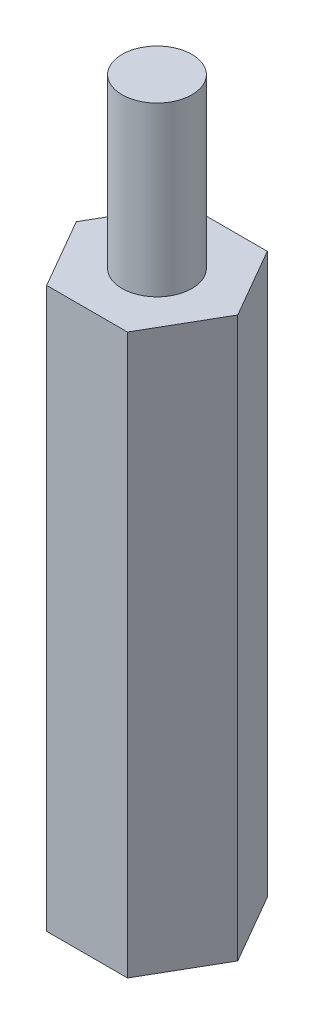
ISO-10303-21;
HEADER;
FILE_DESCRIPTION(('STEP AP214'),'2;1');
FILE_NAME('part.step','',(''),(''),'','','');
FILE_SCHEMA(('AUTOMOTIVE_DESIGN { 1 0 10303 214 1 1 1 1 }'));
ENDSEC;
DATA;
#1=APPLICATION_CONTEXT('core data for automotive mechanical design processes');
#2=APPLICATION_PROTOCOL_DEFINITION('international standard','automotive_design',2000,#1);
#3=PRODUCT_CONTEXT('',#1,'mechanical');
#4=PRODUCT('Part','Part','',(#3));
#5=PRODUCT_RELATED_PRODUCT_CATEGORY('part','',(#4));
#6=PRODUCT_DEFINITION_FORMATION('','',#4);
#7=PRODUCT_DEFINITION_CONTEXT('part definition',#1,'design');
#8=PRODUCT_DEFINITION('design','',#6,#7);
#9=PRODUCT_DEFINITION_SHAPE('','',#8);
#10=(LENGTH_UNIT() NAMED_UNIT(*) SI_UNIT(.MILLI.,.METRE.));
#11=(NAMED_UNIT(*) PLANE_ANGLE_UNIT() SI_UNIT($,.RADIAN.));
#12=(NAMED_UNIT(*) SI_UNIT($,.STERADIAN.) SOLID_ANGLE_UNIT());
#13=UNCERTAINTY_MEASURE_WITH_UNIT(LENGTH_MEASURE(1.E-05),#10,'distance_accuracy_value','');
#14=(GEOMETRIC_REPRESENTATION_CONTEXT(3) GLOBAL_UNCERTAINTY_ASSIGNED_CONTEXT((#13)) GLOBAL_UNIT_ASSIGNED_CONTEXT((#10,
#11,#12)) REPRESENTATION_CONTEXT('',''));
#15=CARTESIAN_POINT('',(0.,0.,0.));
#16=DIRECTION('',(0.,0.,1.));
#17=DIRECTION('',(1.,0.,0.));
#18=AXIS2_PLACEMENT_3D('',#15,#16,#17);
#19=CARTESIAN_POINT('',(-1.44337567297406,20.,-2.5));
#20=DIRECTION('',(0.866025403784439,0.,0.5));
#21=DIRECTION('',(0.5,0.,-0.866025403784439));
#22=AXIS2_PLACEMENT_3D('',#19,#20,#21);
#23=PLANE('',#22);
#24=DIRECTION('',(-0.5,0.,0.866025403784439));
#25=VECTOR('',#24,1.);
#26=CARTESIAN_POINT('',(-1.44337567297406,0.,-2.5));
#27=LINE('',#26,#25);
#28=CARTESIAN_POINT('',(-1.44337567297406,0.,-2.5));
#29=VERTEX_POINT('',#28);
#30=CARTESIAN_POINT('',(-2.88675134594813,0.,0.));
#31=VERTEX_POINT('',#30);
#32=EDGE_CURVE('E129',#29,#31,#27,.T.);
#33=ORIENTED_EDGE('',*,*,#32,.T.);
#34=DIRECTION('',(0.,-1.,0.));
#35=VECTOR('',#34,1.);
#36=CARTESIAN_POINT('',(-2.88675134594813,20.,0.));
#37=LINE('',#36,#35);
#38=CARTESIAN_POINT('',(-2.88675134594813,20.,0.));
#39=VERTEX_POINT('',#38);
#40=EDGE_CURVE('E41',#39,#31,#37,.T.);
#41=ORIENTED_EDGE('',*,*,#40,.F.);
#42=DIRECTION('',(-0.5,0.,0.866025403784439));
#43=VECTOR('',#42,1.);
#44=CARTESIAN_POINT('',(-1.44337567297406,20.,-2.5));
#45=LINE('',#44,#43);
#46=CARTESIAN_POINT('',(-1.44337567297406,20.,-2.5));
#47=VERTEX_POINT('',#46);
#48=EDGE_CURVE('E146',#47,#39,#45,.T.);
#49=ORIENTED_EDGE('',*,*,#48,.F.);
#50=DIRECTION('',(0.,-1.,0.));
#51=VECTOR('',#50,1.);
#52=CARTESIAN_POINT('',(-1.44337567297406,20.,-2.5));
#53=LINE('',#52,#51);
#54=EDGE_CURVE('E125',#47,#29,#53,.T.);
#55=ORIENTED_EDGE('',*,*,#54,.T.);
#56=EDGE_LOOP('',(#33,#41,#49,#55));
#57=FACE_BOUND('',#56,.T.);
#58=ADVANCED_FACE('F38',(#57),#23,.F.);
#59=CARTESIAN_POINT('',(-2.88675134594813,20.,0.));
#60=DIRECTION('',(0.866025403784439,0.,-0.5));
#61=DIRECTION('',(-0.5,0.,-0.866025403784439));
#62=AXIS2_PLACEMENT_3D('',#59,#60,#61);
#63=PLANE('',#62);
#64=DIRECTION('',(0.5,0.,0.866025403784439));
#65=VECTOR('',#64,1.);
#66=CARTESIAN_POINT('',(-2.88675134594813,0.,0.));
#67=LINE('',#66,#65);
#68=CARTESIAN_POINT('',(-1.44337567297406,0.,2.5));
#69=VERTEX_POINT('',#68);
#70=EDGE_CURVE('E133',#31,#69,#67,.T.);
#71=ORIENTED_EDGE('',*,*,#70,.T.);
#72=DIRECTION('',(0.,-1.,0.));
#73=VECTOR('',#72,1.);
#74=CARTESIAN_POINT('',(-1.44337567297406,20.,2.5));
#75=LINE('',#74,#73);
#76=CARTESIAN_POINT('',(-1.44337567297406,20.,2.5));
#77=VERTEX_POINT('',#76);
#78=EDGE_CURVE('E152',#77,#69,#75,.T.);
#79=ORIENTED_EDGE('',*,*,#78,.F.);
#80=DIRECTION('',(0.5,0.,0.866025403784439));
#81=VECTOR('',#80,1.);
#82=CARTESIAN_POINT('',(-2.88675134594813,20.,0.));
#83=LINE('',#82,#81);
#84=EDGE_CURVE('E94',#39,#77,#83,.T.);
#85=ORIENTED_EDGE('',*,*,#84,.F.);
#86=ORIENTED_EDGE('',*,*,#40,.T.);
#87=EDGE_LOOP('',(#71,#79,#85,#86));
#88=FACE_BOUND('',#87,.T.);
#89=ADVANCED_FACE('F159',(#88),#63,.F.);
#90=CARTESIAN_POINT('',(-1.44337567297406,20.,2.5));
#91=DIRECTION('',(0.,0.,-1.));
#92=DIRECTION('',(-1.,0.,0.));
#93=AXIS2_PLACEMENT_3D('',#90,#91,#92);
#94=PLANE('',#93);
#95=DIRECTION('',(1.,0.,0.));
#96=VECTOR('',#95,1.);
#97=CARTESIAN_POINT('',(-1.44337567297406,0.,2.5));
#98=LINE('',#97,#96);
#99=CARTESIAN_POINT('',(1.44337567297406,0.,2.5));
#100=VERTEX_POINT('',#99);
#101=EDGE_CURVE('E137',#69,#100,#98,.T.);
#102=ORIENTED_EDGE('',*,*,#101,.T.);
#103=DIRECTION('',(0.,-1.,0.));
#104=VECTOR('',#103,1.);
#105=CARTESIAN_POINT('',(1.44337567297406,20.,2.5));
#106=LINE('',#105,#104);
#107=CARTESIAN_POINT('',(1.44337567297406,20.,2.5));
#108=VERTEX_POINT('',#107);
#109=EDGE_CURVE('E118',#108,#100,#106,.T.);
#110=ORIENTED_EDGE('',*,*,#109,.F.);
#111=DIRECTION('',(1.,0.,0.));
#112=VECTOR('',#111,1.);
#113=CARTESIAN_POINT('',(-1.44337567297406,20.,2.5));
#114=LINE('',#113,#112);
#115=EDGE_CURVE('E107',#77,#108,#114,.T.);
#116=ORIENTED_EDGE('',*,*,#115,.F.);
#117=ORIENTED_EDGE('',*,*,#78,.T.);
#118=EDGE_LOOP('',(#102,#110,#116,#117));
#119=FACE_BOUND('',#118,.T.);
#120=ADVANCED_FACE('F165',(#119),#94,.F.);
#121=CARTESIAN_POINT('',(1.44337567297406,20.,2.5));
#122=DIRECTION('',(-0.866025403784439,0.,-0.5));
#123=DIRECTION('',(-0.5,0.,0.866025403784439));
#124=AXIS2_PLACEMENT_3D('',#121,#122,#123);
#125=PLANE('',#124);
#126=DIRECTION('',(0.5,0.,-0.866025403784439));
#127=VECTOR('',#126,1.);
#128=CARTESIAN_POINT('',(1.44337567297406,0.,2.5));
#129=LINE('',#128,#127);
#130=CARTESIAN_POINT('',(2.88675134594813,0.,0.));
#131=VERTEX_POINT('',#130);
#132=EDGE_CURVE('E116',#100,#131,#129,.T.);
#133=ORIENTED_EDGE('',*,*,#132,.T.);
#134=DIRECTION('',(0.,-1.,0.));
#135=VECTOR('',#134,1.);
#136=CARTESIAN_POINT('',(2.88675134594813,20.,0.));
#137=LINE('',#136,#135);
#138=CARTESIAN_POINT('',(2.88675134594813,20.,0.));
#139=VERTEX_POINT('',#138);
#140=EDGE_CURVE('E113',#139,#131,#137,.T.);
#141=ORIENTED_EDGE('',*,*,#140,.F.);
#142=DIRECTION('',(0.5,0.,-0.866025403784439));
#143=VECTOR('',#142,1.);
#144=CARTESIAN_POINT('',(1.44337567297406,20.,2.5));
#145=LINE('',#144,#143);
#146=EDGE_CURVE('E101',#108,#139,#145,.T.);
#147=ORIENTED_EDGE('',*,*,#146,.F.);
#148=ORIENTED_EDGE('',*,*,#109,.T.);
#149=EDGE_LOOP('',(#133,#141,#147,#148));
#150=FACE_BOUND('',#149,.T.);
#151=ADVANCED_FACE('F114',(#150),#125,.F.);
#152=CARTESIAN_POINT('',(2.88675134594813,20.,0.));
#153=DIRECTION('',(-0.866025403784438,0.,0.5));
#154=DIRECTION('',(0.5,0.,0.866025403784439));
#155=AXIS2_PLACEMENT_3D('',#152,#153,#154);
#156=PLANE('',#155);
#157=DIRECTION('',(-0.5,0.,-0.866025403784438));
#158=VECTOR('',#157,1.);
#159=CARTESIAN_POINT('',(2.88675134594813,0.,0.));
#160=LINE('',#159,#158);
#161=CARTESIAN_POINT('',(1.44337567297406,0.,-2.5));
#162=VERTEX_POINT('',#161);
#163=EDGE_CURVE('E79',#131,#162,#160,.T.);
#164=ORIENTED_EDGE('',*,*,#163,.T.);
#165=DIRECTION('',(0.,-1.,0.));
#166=VECTOR('',#165,1.);
#167=CARTESIAN_POINT('',(1.44337567297406,20.,-2.5));
#168=LINE('',#167,#166);
#169=CARTESIAN_POINT('',(1.44337567297406,20.,-2.5));
#170=VERTEX_POINT('',#169);
#171=EDGE_CURVE('E119',#170,#162,#168,.T.);
#172=ORIENTED_EDGE('',*,*,#171,.F.);
#173=DIRECTION('',(-0.5,0.,-0.866025403784438));
#174=VECTOR('',#173,1.);
#175=CARTESIAN_POINT('',(2.88675134594813,20.,0.));
#176=LINE('',#175,#174);
#177=EDGE_CURVE('E105',#139,#170,#176,.T.);
#178=ORIENTED_EDGE('',*,*,#177,.F.);
#179=ORIENTED_EDGE('',*,*,#140,.T.);
#180=EDGE_LOOP('',(#164,#172,#178,#179));
#181=FACE_BOUND('',#180,.T.);
#182=ADVANCED_FACE('F121',(#181),#156,.F.);
#183=CARTESIAN_POINT('',(1.44337567297406,20.,-2.5));
#184=DIRECTION('',(0.,0.,1.));
#185=DIRECTION('',(1.,0.,0.));
#186=AXIS2_PLACEMENT_3D('',#183,#184,#185);
#187=PLANE('',#186);
#188=DIRECTION('',(-1.,0.,0.));
#189=VECTOR('',#188,1.);
#190=CARTESIAN_POINT('',(1.44337567297406,0.,-2.5));
#191=LINE('',#190,#189);
#192=EDGE_CURVE('E85',#162,#29,#191,.T.);
#193=ORIENTED_EDGE('',*,*,#192,.T.);
#194=ORIENTED_EDGE('',*,*,#54,.F.);
#195=DIRECTION('',(-1.,0.,0.));
#196=VECTOR('',#195,1.);
#197=CARTESIAN_POINT('',(1.44337567297406,20.,-2.5));
#198=LINE('',#197,#196);
#199=EDGE_CURVE('E56',#170,#47,#198,.T.);
#200=ORIENTED_EDGE('',*,*,#199,.F.);
#201=ORIENTED_EDGE('',*,*,#171,.T.);
#202=EDGE_LOOP('',(#193,#194,#200,#201));
#203=FACE_BOUND('',#202,.T.);
#204=ADVANCED_FACE('F202',(#203),#187,.F.);
#205=CARTESIAN_POINT('',(0.,20.,0.));
#206=DIRECTION('',(0.,1.,0.));
#207=DIRECTION('',(0.,0.,1.));
#208=AXIS2_PLACEMENT_3D('',#205,#206,#207);
#209=PLANE('',#208);
#210=CARTESIAN_POINT('',(0.,20.,0.));
#211=DIRECTION('',(0.,1.,0.));
#212=DIRECTION('',(0.,0.,1.));
#213=AXIS2_PLACEMENT_3D('',#210,#211,#212);
#214=CIRCLE('',#213,1.25);
#215=CARTESIAN_POINT('',(0.,20.,1.25));
#216=VERTEX_POINT('',#215);
#217=EDGE_CURVE('E11',#216,#216,#214,.T.);
#218=ORIENTED_EDGE('',*,*,#217,.F.);
#219=EDGE_LOOP('',(#218));
#220=FACE_BOUND('',#219,.T.);
#221=ORIENTED_EDGE('',*,*,#48,.T.);
#222=ORIENTED_EDGE('',*,*,#84,.T.);
#223=ORIENTED_EDGE('',*,*,#115,.T.);
#224=ORIENTED_EDGE('',*,*,#146,.T.);
#225=ORIENTED_EDGE('',*,*,#177,.T.);
#226=ORIENTED_EDGE('',*,*,#199,.T.);
#227=EDGE_LOOP('',(#221,#222,#223,#224,#225,#226));
#228=FACE_BOUND('',#227,.T.);
#229=ADVANCED_FACE('F103',(#220,#228),#209,.T.);
#230=CARTESIAN_POINT('',(0.,0.,0.));
#231=DIRECTION('',(0.,1.,0.));
#232=DIRECTION('',(0.,0.,1.));
#233=AXIS2_PLACEMENT_3D('',#230,#231,#232);
#234=PLANE('',#233);
#235=CARTESIAN_POINT('',(0.,0.,0.));
#236=DIRECTION('',(0.,-1.,0.));
#237=DIRECTION('',(0.,0.,-1.));
#238=AXIS2_PLACEMENT_3D('',#235,#236,#237);
#239=CIRCLE('',#238,1.25);
#240=CARTESIAN_POINT('',(0.,0.,-1.25));
#241=VERTEX_POINT('',#240);
#242=EDGE_CURVE('E176',#241,#241,#239,.T.);
#243=ORIENTED_EDGE('',*,*,#242,.F.);
#244=EDGE_LOOP('',(#243));
#245=FACE_BOUND('',#244,.T.);
#246=ORIENTED_EDGE('',*,*,#32,.F.);
#247=ORIENTED_EDGE('',*,*,#192,.F.);
#248=ORIENTED_EDGE('',*,*,#163,.F.);
#249=ORIENTED_EDGE('',*,*,#132,.F.);
#250=ORIENTED_EDGE('',*,*,#101,.F.);
#251=ORIENTED_EDGE('',*,*,#70,.F.);
#252=EDGE_LOOP('',(#246,#247,#248,#249,#250,#251));
#253=FACE_BOUND('',#252,.T.);
#254=ADVANCED_FACE('F164',(#245,#253),#234,.F.);
#255=CARTESIAN_POINT('',(0.,26.,0.));
#256=DIRECTION('',(0.,-1.,0.));
#257=DIRECTION('',(0.,0.,-1.));
#258=AXIS2_PLACEMENT_3D('',#255,#256,#257);
#259=CYLINDRICAL_SURFACE('',#258,1.25);
#260=CARTESIAN_POINT('',(0.,26.,0.));
#261=DIRECTION('',(0.,1.,0.));
#262=DIRECTION('',(0.,0.,1.));
#263=AXIS2_PLACEMENT_3D('',#260,#261,#262);
#264=CIRCLE('',#263,1.25);
#265=CARTESIAN_POINT('',(0.,26.,1.25));
#266=VERTEX_POINT('',#265);
#267=EDGE_CURVE('E134',#266,#266,#264,.T.);
#268=ORIENTED_EDGE('',*,*,#267,.F.);
#269=EDGE_LOOP('',(#268));
#270=FACE_BOUND('',#269,.T.);
#271=ORIENTED_EDGE('',*,*,#217,.T.);
#272=EDGE_LOOP('',(#271));
#273=FACE_BOUND('',#272,.T.);
#274=ADVANCED_FACE('F194',(#270,#273),#259,.T.);
#275=CARTESIAN_POINT('',(0.,26.,0.));
#276=DIRECTION('',(0.,1.,0.));
#277=DIRECTION('',(0.,0.,1.));
#278=AXIS2_PLACEMENT_3D('',#275,#276,#277);
#279=PLANE('',#278);
#280=ORIENTED_EDGE('',*,*,#267,.T.);
#281=EDGE_LOOP('',(#280));
#282=FACE_BOUND('',#281,.T.);
#283=ADVANCED_FACE('F189',(#282),#279,.T.);
#284=CARTESIAN_POINT('',(0.,6.,0.));
#285=DIRECTION('',(0.,-1.,0.));
#286=DIRECTION('',(0.,0.,-1.));
#287=AXIS2_PLACEMENT_3D('',#284,#285,#286);
#288=CYLINDRICAL_SURFACE('',#287,1.25);
#289=CARTESIAN_POINT('',(0.,6.,0.));
#290=DIRECTION('',(0.,-1.,0.));
#291=DIRECTION('',(0.,0.,-1.));
#292=AXIS2_PLACEMENT_3D('',#289,#290,#291);
#293=CIRCLE('',#292,1.25);
#294=CARTESIAN_POINT('',(0.,6.,-1.25));
#295=VERTEX_POINT('',#294);
#296=EDGE_CURVE('E175',#295,#295,#293,.T.);
#297=ORIENTED_EDGE('',*,*,#296,.F.);
#298=EDGE_LOOP('',(#297));
#299=FACE_BOUND('',#298,.T.);
#300=ORIENTED_EDGE('',*,*,#242,.T.);
#301=EDGE_LOOP('',(#300));
#302=FACE_BOUND('',#301,.T.);
#303=ADVANCED_FACE('F186',(#299,#302),#288,.F.);
#304=CARTESIAN_POINT('',(0.,6.,0.));
#305=DIRECTION('',(0.,-1.,0.));
#306=DIRECTION('',(0.,0.,-1.));
#307=AXIS2_PLACEMENT_3D('',#304,#305,#306);
#308=PLANE('',#307);
#309=ORIENTED_EDGE('',*,*,#296,.T.);
#310=EDGE_LOOP('',(#309));
#311=FACE_BOUND('',#310,.T.);
#312=ADVANCED_FACE('F184',(#311),#308,.T.);
#313=CLOSED_SHELL('',(#58,#89,#120,#151,#182,#204,#229,#254,#274,#283,#303,#312));
#314=MANIFOLD_SOLID_BREP('B2',#313);
#315=ADVANCED_BREP_SHAPE_REPRESENTATION('',(#18,#314),#14);
#316=SHAPE_DEFINITION_REPRESENTATION(#9,#315);
ENDSEC;
END-ISO-10303-21;
